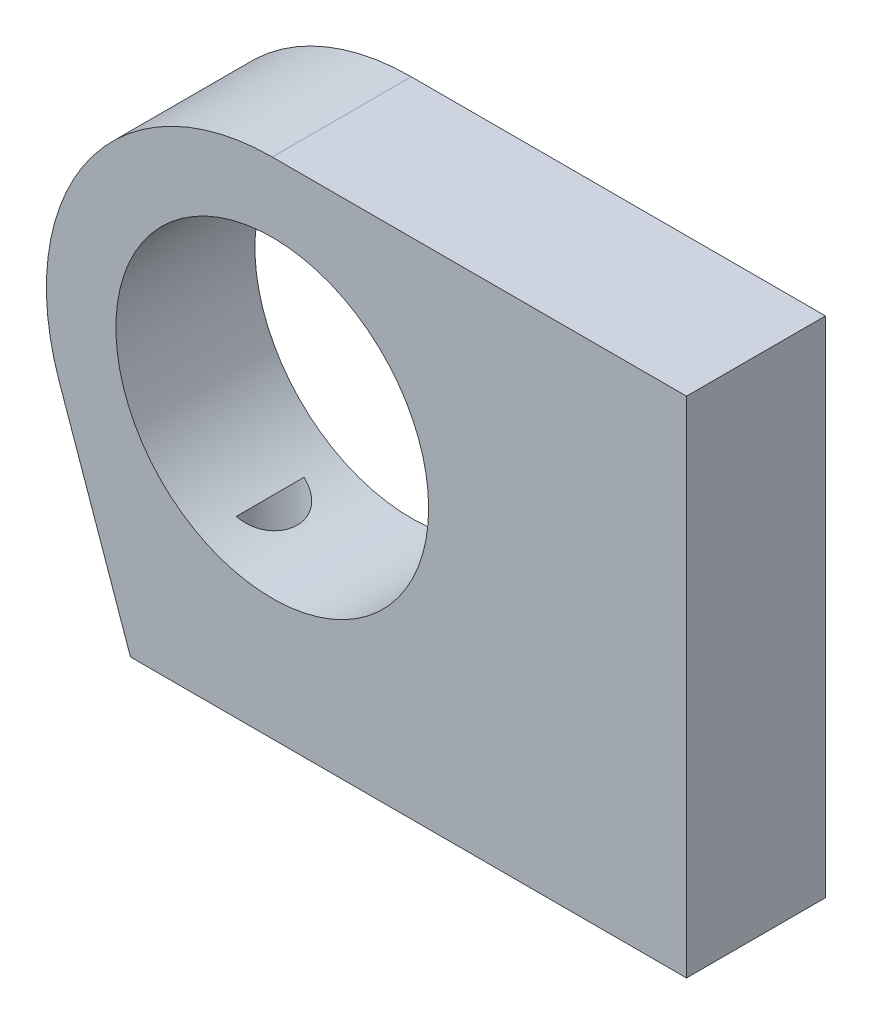
ISO-10303-21;
HEADER;
FILE_DESCRIPTION(('STEP AP214'),'2;1');
FILE_NAME('part.step','',(''),(''),'','','');
FILE_SCHEMA(('AUTOMOTIVE_DESIGN { 1 0 10303 214 1 1 1 1 }'));
ENDSEC;
DATA;
#1=APPLICATION_CONTEXT('core data for automotive mechanical design processes');
#2=APPLICATION_PROTOCOL_DEFINITION('international standard','automotive_design',2000,#1);
#3=PRODUCT_CONTEXT('',#1,'mechanical');
#4=PRODUCT('Part','Part','',(#3));
#5=PRODUCT_RELATED_PRODUCT_CATEGORY('part','',(#4));
#6=PRODUCT_DEFINITION_FORMATION('','',#4);
#7=PRODUCT_DEFINITION_CONTEXT('part definition',#1,'design');
#8=PRODUCT_DEFINITION('design','',#6,#7);
#9=PRODUCT_DEFINITION_SHAPE('','',#8);
#10=(LENGTH_UNIT() NAMED_UNIT(*) SI_UNIT(.MILLI.,.METRE.));
#11=(NAMED_UNIT(*) PLANE_ANGLE_UNIT() SI_UNIT($,.RADIAN.));
#12=(NAMED_UNIT(*) SI_UNIT($,.STERADIAN.) SOLID_ANGLE_UNIT());
#13=UNCERTAINTY_MEASURE_WITH_UNIT(LENGTH_MEASURE(1.E-05),#10,'distance_accuracy_value','');
#14=(GEOMETRIC_REPRESENTATION_CONTEXT(3) GLOBAL_UNCERTAINTY_ASSIGNED_CONTEXT((#13)) GLOBAL_UNIT_ASSIGNED_CONTEXT((#10,
#11,#12)) REPRESENTATION_CONTEXT('',''));
#15=CARTESIAN_POINT('',(0.,0.,0.));
#16=DIRECTION('',(0.,0.,1.));
#17=DIRECTION('',(1.,0.,0.));
#18=AXIS2_PLACEMENT_3D('',#15,#16,#17);
#19=CARTESIAN_POINT('',(0.,46.0375,12.7));
#20=DIRECTION('',(0.,-1.,0.));
#21=DIRECTION('',(1.,0.,0.));
#22=AXIS2_PLACEMENT_3D('',#19,#20,#21);
#23=PLANE('',#22);
#24=DIRECTION('',(-1.,0.,0.));
#25=VECTOR('',#24,1.);
#26=CARTESIAN_POINT('',(0.,46.0375,0.));
#27=LINE('',#26,#25);
#28=CARTESIAN_POINT('',(50.8,46.0375,0.));
#29=VERTEX_POINT('',#28);
#30=CARTESIAN_POINT('',(12.954,46.0375,0.));
#31=VERTEX_POINT('',#30);
#32=EDGE_CURVE('E143',#29,#31,#27,.T.);
#33=ORIENTED_EDGE('',*,*,#32,.T.);
#34=DIRECTION('',(0.,0.,-1.));
#35=VECTOR('',#34,1.);
#36=CARTESIAN_POINT('',(12.954,46.0375,12.7));
#37=LINE('',#36,#35);
#38=CARTESIAN_POINT('',(12.954,46.0375,12.7));
#39=VERTEX_POINT('',#38);
#40=EDGE_CURVE('E169',#39,#31,#37,.T.);
#41=ORIENTED_EDGE('',*,*,#40,.F.);
#42=DIRECTION('',(-1.,0.,0.));
#43=VECTOR('',#42,1.);
#44=CARTESIAN_POINT('',(0.,46.0375,12.7));
#45=LINE('',#44,#43);
#46=CARTESIAN_POINT('',(50.8,46.0375,12.7));
#47=VERTEX_POINT('',#46);
#48=EDGE_CURVE('E132',#47,#39,#45,.T.);
#49=ORIENTED_EDGE('',*,*,#48,.F.);
#50=DIRECTION('',(0.,0.,-1.));
#51=VECTOR('',#50,1.);
#52=CARTESIAN_POINT('',(50.8,46.0375,12.7));
#53=LINE('',#52,#51);
#54=EDGE_CURVE('E142',#47,#29,#53,.T.);
#55=ORIENTED_EDGE('',*,*,#54,.T.);
#56=EDGE_LOOP('',(#33,#41,#49,#55));
#57=FACE_BOUND('',#56,.T.);
#58=ADVANCED_FACE('F41',(#57),#23,.F.);
#59=CARTESIAN_POINT('',(12.954,25.4,12.7));
#60=DIRECTION('',(0.,0.,-1.));
#61=DIRECTION('',(-1.,0.,0.));
#62=AXIS2_PLACEMENT_3D('',#59,#60,#61);
#63=CYLINDRICAL_SURFACE('',#62,20.6375);
#64=CARTESIAN_POINT('',(12.954,25.4,0.));
#65=DIRECTION('',(0.,0.,1.));
#66=DIRECTION('',(1.,0.,0.));
#67=AXIS2_PLACEMENT_3D('',#64,#65,#66);
#68=CIRCLE('',#67,20.6375);
#69=CARTESIAN_POINT('',(-6.51798910793063,18.5627456950446,0.));
#70=VERTEX_POINT('',#69);
#71=EDGE_CURVE('E147',#31,#70,#68,.T.);
#72=ORIENTED_EDGE('',*,*,#71,.T.);
#73=DIRECTION('',(0.,0.,-1.));
#74=VECTOR('',#73,1.);
#75=CARTESIAN_POINT('',(-6.51798910793063,18.5627456950446,12.7));
#76=LINE('',#75,#74);
#77=CARTESIAN_POINT('',(-6.51798910793063,18.5627456950446,12.7));
#78=VERTEX_POINT('',#77);
#79=EDGE_CURVE('E119',#78,#70,#76,.T.);
#80=ORIENTED_EDGE('',*,*,#79,.F.);
#81=CARTESIAN_POINT('',(12.954,25.4,12.7));
#82=DIRECTION('',(0.,0.,1.));
#83=DIRECTION('',(1.,0.,0.));
#84=AXIS2_PLACEMENT_3D('',#81,#82,#83);
#85=CIRCLE('',#84,20.6375);
#86=EDGE_CURVE('E102',#39,#78,#85,.T.);
#87=ORIENTED_EDGE('',*,*,#86,.F.);
#88=ORIENTED_EDGE('',*,*,#40,.T.);
#89=EDGE_LOOP('',(#72,#80,#87,#88));
#90=FACE_BOUND('',#89,.T.);
#91=ADVANCED_FACE('F197',(#90),#63,.T.);
#92=CARTESIAN_POINT('',(0.,0.,12.7));
#93=DIRECTION('',(-0.943524608500576,-0.331302449664706,0.));
#94=DIRECTION('',(0.331302449664706,-0.943524608500576,0.));
#95=AXIS2_PLACEMENT_3D('',#92,#93,#94);
#96=PLANE('',#95);
#97=DIRECTION('',(-0.331302449664706,0.943524608500576,0.));
#98=VECTOR('',#97,1.);
#99=CARTESIAN_POINT('',(0.,0.,0.));
#100=LINE('',#99,#98);
#101=CARTESIAN_POINT('',(0.,0.,0.));
#102=VERTEX_POINT('',#101);
#103=EDGE_CURVE('E115',#102,#70,#100,.T.);
#104=ORIENTED_EDGE('',*,*,#103,.F.);
#105=DIRECTION('',(0.,0.,-1.));
#106=VECTOR('',#105,1.);
#107=CARTESIAN_POINT('',(0.,0.,12.7));
#108=LINE('',#107,#106);
#109=CARTESIAN_POINT('',(0.,0.,12.7));
#110=VERTEX_POINT('',#109);
#111=EDGE_CURVE('E109',#110,#102,#108,.T.);
#112=ORIENTED_EDGE('',*,*,#111,.F.);
#113=DIRECTION('',(-0.331302449664706,0.943524608500576,0.));
#114=VECTOR('',#113,1.);
#115=CARTESIAN_POINT('',(0.,0.,12.7));
#116=LINE('',#115,#114);
#117=EDGE_CURVE('E113',#110,#78,#116,.T.);
#118=ORIENTED_EDGE('',*,*,#117,.T.);
#119=ORIENTED_EDGE('',*,*,#79,.T.);
#120=EDGE_LOOP('',(#104,#112,#118,#119));
#121=FACE_BOUND('',#120,.T.);
#122=ADVANCED_FACE('F111',(#121),#96,.T.);
#123=CARTESIAN_POINT('',(0.,0.,12.7));
#124=DIRECTION('',(0.,1.,0.));
#125=DIRECTION('',(0.,0.,1.));
#126=AXIS2_PLACEMENT_3D('',#123,#124,#125);
#127=PLANE('',#126);
#128=CARTESIAN_POINT('',(45.085,0.,6.35));
#129=DIRECTION('',(0.,-1.,0.));
#130=DIRECTION('',(0.,0.,-1.));
#131=AXIS2_PLACEMENT_3D('',#128,#129,#130);
#132=CIRCLE('',#131,3.175);
#133=CARTESIAN_POINT('',(45.085,0.,3.175));
#134=VERTEX_POINT('',#133);
#135=EDGE_CURVE('E182',#134,#134,#132,.T.);
#136=ORIENTED_EDGE('',*,*,#135,.F.);
#137=EDGE_LOOP('',(#136));
#138=FACE_BOUND('',#137,.T.);
#139=CARTESIAN_POINT('',(5.715,0.,6.35));
#140=DIRECTION('',(0.,-1.,0.));
#141=DIRECTION('',(0.,0.,-1.));
#142=AXIS2_PLACEMENT_3D('',#139,#140,#141);
#143=CIRCLE('',#142,3.175);
#144=CARTESIAN_POINT('',(5.715,0.,3.175));
#145=VERTEX_POINT('',#144);
#146=EDGE_CURVE('E183',#145,#145,#143,.T.);
#147=ORIENTED_EDGE('',*,*,#146,.F.);
#148=EDGE_LOOP('',(#147));
#149=FACE_BOUND('',#148,.T.);
#150=DIRECTION('',(1.,0.,0.));
#151=VECTOR('',#150,1.);
#152=CARTESIAN_POINT('',(0.,0.,0.));
#153=LINE('',#152,#151);
#154=CARTESIAN_POINT('',(50.8,0.,0.));
#155=VERTEX_POINT('',#154);
#156=EDGE_CURVE('E154',#102,#155,#153,.T.);
#157=ORIENTED_EDGE('',*,*,#156,.T.);
#158=DIRECTION('',(0.,0.,-1.));
#159=VECTOR('',#158,1.);
#160=CARTESIAN_POINT('',(50.8,0.,12.7));
#161=LINE('',#160,#159);
#162=CARTESIAN_POINT('',(50.8,0.,12.7));
#163=VERTEX_POINT('',#162);
#164=EDGE_CURVE('E120',#163,#155,#161,.T.);
#165=ORIENTED_EDGE('',*,*,#164,.F.);
#166=DIRECTION('',(1.,0.,0.));
#167=VECTOR('',#166,1.);
#168=CARTESIAN_POINT('',(0.,0.,12.7));
#169=LINE('',#168,#167);
#170=EDGE_CURVE('E123',#110,#163,#169,.T.);
#171=ORIENTED_EDGE('',*,*,#170,.F.);
#172=ORIENTED_EDGE('',*,*,#111,.T.);
#173=EDGE_LOOP('',(#157,#165,#171,#172));
#174=FACE_BOUND('',#173,.T.);
#175=ADVANCED_FACE('F124',(#138,#149,#174),#127,.F.);
#176=CARTESIAN_POINT('',(50.8,0.,12.7));
#177=DIRECTION('',(-1.,0.,0.));
#178=DIRECTION('',(0.,0.,1.));
#179=AXIS2_PLACEMENT_3D('',#176,#177,#178);
#180=PLANE('',#179);
#181=DIRECTION('',(0.,1.,0.));
#182=VECTOR('',#181,1.);
#183=CARTESIAN_POINT('',(50.8,0.,0.));
#184=LINE('',#183,#182);
#185=EDGE_CURVE('E93',#155,#29,#184,.T.);
#186=ORIENTED_EDGE('',*,*,#185,.T.);
#187=ORIENTED_EDGE('',*,*,#54,.F.);
#188=DIRECTION('',(0.,1.,0.));
#189=VECTOR('',#188,1.);
#190=CARTESIAN_POINT('',(50.8,0.,12.7));
#191=LINE('',#190,#189);
#192=EDGE_CURVE('E69',#163,#47,#191,.T.);
#193=ORIENTED_EDGE('',*,*,#192,.F.);
#194=ORIENTED_EDGE('',*,*,#164,.T.);
#195=EDGE_LOOP('',(#186,#187,#193,#194));
#196=FACE_BOUND('',#195,.T.);
#197=ADVANCED_FACE('F201',(#196),#180,.F.);
#198=CARTESIAN_POINT('',(12.954,25.4,12.7));
#199=DIRECTION('',(0.,0.,-1.));
#200=DIRECTION('',(-1.,0.,0.));
#201=AXIS2_PLACEMENT_3D('',#198,#199,#200);
#202=CYLINDRICAL_SURFACE('',#201,14.2875);
#203=CARTESIAN_POINT('',(6.40856981933195,12.7,9.4483198520669));
#204=CARTESIAN_POINT('',(6.49262928168268,12.6566669697783,9.42951212219705));
#205=CARTESIAN_POINT('',(6.57651295891145,12.6145001774041,9.40713286010597));
#206=CARTESIAN_POINT('',(6.74329910889615,12.5326608077111,9.35513654497577));
#207=CARTESIAN_POINT('',(6.82620107963219,12.4929894652788,9.325515943402));
#208=CARTESIAN_POINT('',(6.99052144956766,12.4162470414004,9.25887490296913));
#209=CARTESIAN_POINT('',(7.07193548249217,12.3791829133671,9.22183561964134));
#210=CARTESIAN_POINT('',(7.23230413698857,12.3079204638186,9.14042952876586));
#211=CARTESIAN_POINT('',(7.31125916612597,12.2737216657863,9.09606394327513));
#212=CARTESIAN_POINT('',(7.46620406011125,12.2081899497105,8.99995218247211));
#213=CARTESIAN_POINT('',(7.54218347031693,12.1768666927032,8.94818252169447));
#214=CARTESIAN_POINT('',(7.69013661002704,12.1172757800284,8.83756835786316));
#215=CARTESIAN_POINT('',(7.76210879004813,12.0890093024052,8.77872114553358));
#216=CARTESIAN_POINT('',(7.90109447281518,12.0356319402649,8.65440574815809));
#217=CARTESIAN_POINT('',(7.96811737955947,12.0105150044527,8.58895070986013));
#218=CARTESIAN_POINT('',(8.09660860100074,11.9633674683433,8.45176525612388));
#219=CARTESIAN_POINT('',(8.15807499863943,11.9413379318021,8.38003269153996));
#220=CARTESIAN_POINT('',(8.32506740402169,11.8826444498078,8.16637397258932));
#221=CARTESIAN_POINT('',(8.42290903947735,11.849731360486,8.01723406978177));
#222=CARTESIAN_POINT('',(8.5927466647164,11.7941121002317,7.70318814910387));
#223=CARTESIAN_POINT('',(8.66473568588146,11.7714086809188,7.53827789545328));
#224=CARTESIAN_POINT('',(8.77767650571949,11.7363863261496,7.2046251881315));
#225=CARTESIAN_POINT('',(8.81976713624475,11.7236840908142,7.03630836736553));
#226=CARTESIAN_POINT('',(8.8759771414601,11.7068168089767,6.69468564227735));
#227=CARTESIAN_POINT('',(8.89010319788656,11.7026497231141,6.52138093978105));
#228=CARTESIAN_POINT('',(8.88989680766538,11.702711363148,6.17672707644696));
#229=CARTESIAN_POINT('',(8.87587926601057,11.7068471859021,6.00537761291652));
#230=CARTESIAN_POINT('',(8.82051186451713,11.7234596331777,5.66756727696588));
#231=CARTESIAN_POINT('',(8.77916172611864,11.7359363427055,5.50110645438626));
#232=CARTESIAN_POINT('',(8.67062211047569,11.7695732911203,5.17782883509445));
#233=CARTESIAN_POINT('',(8.60344080900471,11.7907307826113,5.02100900512706));
#234=CARTESIAN_POINT('',(8.44567739227697,11.8421781262004,4.72128738562456));
#235=CARTESIAN_POINT('',(8.35509715804296,11.8724672442466,4.57838447858937));
#236=CARTESIAN_POINT('',(8.15290114228945,11.9428965099533,4.30894773350818));
#237=CARTESIAN_POINT('',(8.04109919631958,11.9831248693465,4.18257688456665));
#238=CARTESIAN_POINT('',(7.80106725807857,12.0734718312927,3.950664178783));
#239=CARTESIAN_POINT('',(7.67283177311779,12.123593743673,3.84512931618973));
#240=CARTESIAN_POINT('',(7.40000149005536,12.2353433275413,3.65368847215736));
#241=CARTESIAN_POINT('',(7.25500561967952,12.2972970037139,3.56854808572109));
#242=CARTESIAN_POINT('',(6.9572536944331,12.4308738511851,3.42342833549852));
#243=CARTESIAN_POINT('',(6.80450470572726,12.5024883129831,3.36342650628289));
#244=CARTESIAN_POINT('',(6.61011569449593,12.5980542616511,3.3034992294187));
#245=CARTESIAN_POINT('',(6.56987185841964,12.618074743527,3.29196713460018));
#246=CARTESIAN_POINT('',(6.48929431279829,12.6586399216061,3.27058081986369));
#247=CARTESIAN_POINT('',(6.44896087680962,12.6791836571485,3.26072374871547));
#248=CARTESIAN_POINT('',(6.40856981933195,12.7,3.2516801479331));
#249=B_SPLINE_CURVE_WITH_KNOTS('',3,(#203,#204,#205,#206,#207,#208,#209,#210,#211,#212,#213,
#214,#215,#216,#217,#218,#219,#220,#221,#222,#223,#224,#225,#226,#227,#228,#229,#230,#231,#232,
#233,#234,#235,#236,#237,#238,#239,#240,#241,#242,#243,#244,#245,#246,#247,#248),.UNSPECIFIED.,
.F.,.F.,(4,2,2,2,2,2,2,2,2,2,2,2,2,2,2,2,2,2,2,2,2,2,4),(0.,0.289226456911084,0.578594931007178,
0.868707981548663,1.15877268884614,1.44977876335391,1.74089659123581,2.03144622581323,
2.32209572373149,2.86324526300144,3.40454056080165,3.92391545343749,4.4431662338605,
4.95663938136472,5.47011776200562,5.98343375616111,6.49670849806125,7.01471342752193,
7.53289194695294,8.06822712009181,8.60308285757036,8.74227810630687,8.88123399002888),.UNSPECIFIED.);
#250=CARTESIAN_POINT('',(6.40856981933195,12.7,9.4483198520669));
#251=VERTEX_POINT('',#250);
#252=CARTESIAN_POINT('',(6.40856981933195,12.7,3.2516801479331));
#253=VERTEX_POINT('',#252);
#254=EDGE_CURVE('E11',#251,#253,#249,.T.);
#255=ORIENTED_EDGE('',*,*,#254,.F.);
#256=DIRECTION('',(0.,0.,-1.));
#257=VECTOR('',#256,1.);
#258=CARTESIAN_POINT('',(6.40856981933195,12.7,12.7));
#259=LINE('',#258,#257);
#260=EDGE_CURVE('E55',#251,#253,#259,.T.);
#261=ORIENTED_EDGE('',*,*,#260,.T.);
#262=EDGE_LOOP('',(#255,#261));
#263=FACE_BOUND('',#262,.T.);
#264=CARTESIAN_POINT('',(12.954,25.4,12.7));
#265=DIRECTION('',(0.,0.,1.));
#266=DIRECTION('',(1.,0.,0.));
#267=AXIS2_PLACEMENT_3D('',#264,#265,#266);
#268=CIRCLE('',#267,14.2875);
#269=CARTESIAN_POINT('',(27.2415,25.4,12.7));
#270=VERTEX_POINT('',#269);
#271=EDGE_CURVE('E138',#270,#270,#268,.T.);
#272=ORIENTED_EDGE('',*,*,#271,.T.);
#273=EDGE_LOOP('',(#272));
#274=FACE_BOUND('',#273,.T.);
#275=CARTESIAN_POINT('',(12.954,25.4,0.));
#276=DIRECTION('',(0.,0.,1.));
#277=DIRECTION('',(1.,0.,0.));
#278=AXIS2_PLACEMENT_3D('',#275,#276,#277);
#279=CIRCLE('',#278,14.2875);
#280=CARTESIAN_POINT('',(27.2415,25.4,0.));
#281=VERTEX_POINT('',#280);
#282=EDGE_CURVE('E159',#281,#281,#279,.T.);
#283=ORIENTED_EDGE('',*,*,#282,.F.);
#284=EDGE_LOOP('',(#283));
#285=FACE_BOUND('',#284,.T.);
#286=ADVANCED_FACE('F175',(#263,#274,#285),#202,.F.);
#287=CARTESIAN_POINT('',(0.,0.,12.7));
#288=DIRECTION('',(0.,0.,1.));
#289=DIRECTION('',(1.,0.,0.));
#290=AXIS2_PLACEMENT_3D('',#287,#288,#289);
#291=PLANE('',#290);
#292=ORIENTED_EDGE('',*,*,#48,.T.);
#293=ORIENTED_EDGE('',*,*,#86,.T.);
#294=ORIENTED_EDGE('',*,*,#117,.F.);
#295=ORIENTED_EDGE('',*,*,#170,.T.);
#296=ORIENTED_EDGE('',*,*,#192,.T.);
#297=EDGE_LOOP('',(#292,#293,#294,#295,#296));
#298=FACE_BOUND('',#297,.T.);
#299=ORIENTED_EDGE('',*,*,#271,.F.);
#300=EDGE_LOOP('',(#299));
#301=FACE_BOUND('',#300,.T.);
#302=ADVANCED_FACE('F127',(#298,#301),#291,.T.);
#303=CARTESIAN_POINT('',(0.,0.,0.));
#304=DIRECTION('',(0.,0.,1.));
#305=DIRECTION('',(1.,0.,0.));
#306=AXIS2_PLACEMENT_3D('',#303,#304,#305);
#307=PLANE('',#306);
#308=ORIENTED_EDGE('',*,*,#32,.F.);
#309=ORIENTED_EDGE('',*,*,#185,.F.);
#310=ORIENTED_EDGE('',*,*,#156,.F.);
#311=ORIENTED_EDGE('',*,*,#103,.T.);
#312=ORIENTED_EDGE('',*,*,#71,.F.);
#313=EDGE_LOOP('',(#308,#309,#310,#311,#312));
#314=FACE_BOUND('',#313,.T.);
#315=ORIENTED_EDGE('',*,*,#282,.T.);
#316=EDGE_LOOP('',(#315));
#317=FACE_BOUND('',#316,.T.);
#318=ADVANCED_FACE('F199',(#314,#317),#307,.F.);
#319=CARTESIAN_POINT('',(5.715,12.7,6.35));
#320=DIRECTION('',(0.,-1.,0.));
#321=DIRECTION('',(0.,0.,-1.));
#322=AXIS2_PLACEMENT_3D('',#319,#320,#321);
#323=CYLINDRICAL_SURFACE('',#322,3.175);
#324=ORIENTED_EDGE('',*,*,#254,.T.);
#325=CARTESIAN_POINT('',(5.715,12.7,6.35));
#326=DIRECTION('',(0.,-1.,0.));
#327=DIRECTION('',(0.,0.,-1.));
#328=AXIS2_PLACEMENT_3D('',#325,#326,#327);
#329=CIRCLE('',#328,3.175);
#330=EDGE_CURVE('E61',#251,#253,#329,.T.);
#331=ORIENTED_EDGE('',*,*,#330,.F.);
#332=EDGE_LOOP('',(#324,#331));
#333=FACE_BOUND('',#332,.T.);
#334=ORIENTED_EDGE('',*,*,#146,.T.);
#335=EDGE_LOOP('',(#334));
#336=FACE_BOUND('',#335,.T.);
#337=ADVANCED_FACE('F179',(#333,#336),#323,.F.);
#338=CARTESIAN_POINT('',(5.715,12.7,6.35));
#339=DIRECTION('',(0.,-1.,0.));
#340=DIRECTION('',(0.,0.,-1.));
#341=AXIS2_PLACEMENT_3D('',#338,#339,#340);
#342=PLANE('',#341);
#343=ORIENTED_EDGE('',*,*,#330,.T.);
#344=ORIENTED_EDGE('',*,*,#260,.F.);
#345=EDGE_LOOP('',(#343,#344));
#346=FACE_BOUND('',#345,.T.);
#347=ADVANCED_FACE('F177',(#346),#342,.T.);
#348=CARTESIAN_POINT('',(45.085,12.7,6.35));
#349=DIRECTION('',(0.,-1.,0.));
#350=DIRECTION('',(0.,0.,-1.));
#351=AXIS2_PLACEMENT_3D('',#348,#349,#350);
#352=CYLINDRICAL_SURFACE('',#351,3.175);
#353=CARTESIAN_POINT('',(45.085,12.7,6.35));
#354=DIRECTION('',(0.,-1.,0.));
#355=DIRECTION('',(0.,0.,-1.));
#356=AXIS2_PLACEMENT_3D('',#353,#354,#355);
#357=CIRCLE('',#356,3.175);
#358=CARTESIAN_POINT('',(45.085,12.7,3.175));
#359=VERTEX_POINT('',#358);
#360=EDGE_CURVE('E148',#359,#359,#357,.T.);
#361=ORIENTED_EDGE('',*,*,#360,.F.);
#362=EDGE_LOOP('',(#361));
#363=FACE_BOUND('',#362,.T.);
#364=ORIENTED_EDGE('',*,*,#135,.T.);
#365=EDGE_LOOP('',(#364));
#366=FACE_BOUND('',#365,.T.);
#367=ADVANCED_FACE('F254',(#363,#366),#352,.F.);
#368=CARTESIAN_POINT('',(45.085,12.7,6.35));
#369=DIRECTION('',(0.,-1.,0.));
#370=DIRECTION('',(0.,0.,-1.));
#371=AXIS2_PLACEMENT_3D('',#368,#369,#370);
#372=PLANE('',#371);
#373=ORIENTED_EDGE('',*,*,#360,.T.);
#374=EDGE_LOOP('',(#373));
#375=FACE_BOUND('',#374,.T.);
#376=ADVANCED_FACE('F263',(#375),#372,.T.);
#377=CLOSED_SHELL('',(#58,#91,#122,#175,#197,#286,#302,#318,#337,#347,#367,#376));
#378=MANIFOLD_SOLID_BREP('B2',#377);
#379=ADVANCED_BREP_SHAPE_REPRESENTATION('',(#18,#378),#14);
#380=SHAPE_DEFINITION_REPRESENTATION(#9,#379);
ENDSEC;
END-ISO-10303-21;
